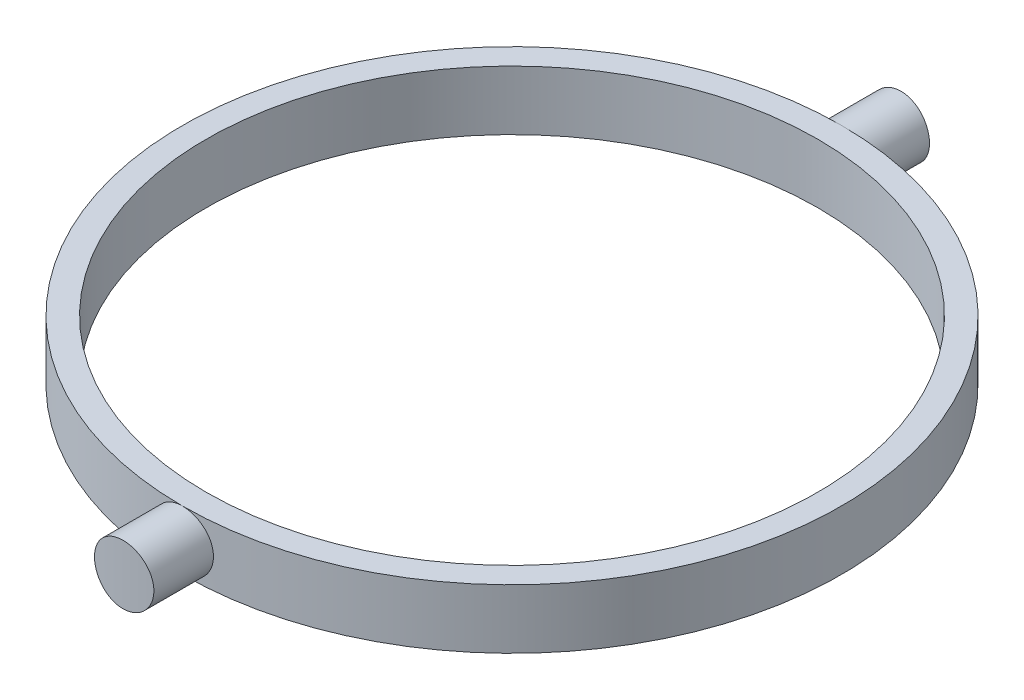
ISO-10303-21;
HEADER;
FILE_DESCRIPTION(('STEP AP214'),'2;1');
FILE_NAME('part.step','',(''),(''),'','','');
FILE_SCHEMA(('AUTOMOTIVE_DESIGN { 1 0 10303 214 1 1 1 1 }'));
ENDSEC;
DATA;
#1=APPLICATION_CONTEXT('core data for automotive mechanical design processes');
#2=APPLICATION_PROTOCOL_DEFINITION('international standard','automotive_design',2000,#1);
#3=PRODUCT_CONTEXT('',#1,'mechanical');
#4=PRODUCT('Part','Part','',(#3));
#5=PRODUCT_RELATED_PRODUCT_CATEGORY('part','',(#4));
#6=PRODUCT_DEFINITION_FORMATION('','',#4);
#7=PRODUCT_DEFINITION_CONTEXT('part definition',#1,'design');
#8=PRODUCT_DEFINITION('design','',#6,#7);
#9=PRODUCT_DEFINITION_SHAPE('','',#8);
#10=(LENGTH_UNIT() NAMED_UNIT(*) SI_UNIT(.MILLI.,.METRE.));
#11=(NAMED_UNIT(*) PLANE_ANGLE_UNIT() SI_UNIT($,.RADIAN.));
#12=(NAMED_UNIT(*) SI_UNIT($,.STERADIAN.) SOLID_ANGLE_UNIT());
#13=UNCERTAINTY_MEASURE_WITH_UNIT(LENGTH_MEASURE(1.E-05),#10,'distance_accuracy_value','');
#14=(GEOMETRIC_REPRESENTATION_CONTEXT(3) GLOBAL_UNCERTAINTY_ASSIGNED_CONTEXT((#13)) GLOBAL_UNIT_ASSIGNED_CONTEXT((#10,
#11,#12)) REPRESENTATION_CONTEXT('',''));
#15=CARTESIAN_POINT('',(0.,0.,0.));
#16=DIRECTION('',(0.,0.,1.));
#17=DIRECTION('',(1.,0.,0.));
#18=AXIS2_PLACEMENT_3D('',#15,#16,#17);
#19=CARTESIAN_POINT('',(0.,2.5,0.));
#20=DIRECTION('',(0.,-1.,0.));
#21=DIRECTION('',(0.,0.,-1.));
#22=AXIS2_PLACEMENT_3D('',#19,#20,#21);
#23=CYLINDRICAL_SURFACE('',#22,27.75);
#24=CARTESIAN_POINT('',(0.,2.5,-27.75));
#25=CARTESIAN_POINT('',(0.0701636798699895,2.50000690088817,-27.7500025790525));
#26=CARTESIAN_POINT('',(0.140323974462708,2.49704627125547,-27.7497339492877));
#27=CARTESIAN_POINT('',(0.280139841908848,2.48524338112585,-27.7486733268127));
#28=CARTESIAN_POINT('',(0.34979544614194,2.47640148953078,-27.7478813669284));
#29=CARTESIAN_POINT('',(0.488052874380236,2.45289969782349,-27.7457940407847));
#30=CARTESIAN_POINT('',(0.556655560620711,2.43824485461847,-27.7444991120973));
#31=CARTESIAN_POINT('',(0.692360655207406,2.40323823349337,-27.7414446799347));
#32=CARTESIAN_POINT('',(0.759463077056216,2.38288650686834,-27.7396851806426));
#33=CARTESIAN_POINT('',(0.957862366758913,2.31345849018642,-27.7337777508864));
#34=CARTESIAN_POINT('',(1.08631987342726,2.25599763178239,-27.7289997811642));
#35=CARTESIAN_POINT('',(1.33167825447004,2.12044899142266,-27.718302093102));
#36=CARTESIAN_POINT('',(1.44858069024329,2.04236400158889,-27.7123825293416));
#37=CARTESIAN_POINT('',(1.66795473274738,1.86752180473426,-27.7000457433074));
#38=CARTESIAN_POINT('',(1.77038907866499,1.77071785373396,-27.6936272997691));
#39=CARTESIAN_POINT('',(1.95758632151276,1.56127845742341,-27.6810257413625));
#40=CARTESIAN_POINT('',(2.04234651962052,1.44864059868319,-27.6748426625518));
#41=CARTESIAN_POINT('',(2.19191333655304,1.21050278199722,-27.6633994811436));
#42=CARTESIAN_POINT('',(2.25668603959202,1.08498143831527,-27.658140953804));
#43=CARTESIAN_POINT('',(2.36421718764613,0.824796916540191,-27.6491574198875));
#44=CARTESIAN_POINT('',(2.40697741389054,0.690134479134349,-27.6454322892345));
#45=CARTESIAN_POINT('',(2.46916370477388,0.415870917750558,-27.6399477650127));
#46=CARTESIAN_POINT('',(2.48865280196746,0.276284193829632,-27.6381830623055));
#47=CARTESIAN_POINT('',(2.50393834041468,-0.00419287642927001,-27.6368025434905));
#48=CARTESIAN_POINT('',(2.49973471390577,-0.145083226494542,-27.6371867335286));
#49=CARTESIAN_POINT('',(2.46780537259071,-0.423727511322421,-27.6400558309261));
#50=CARTESIAN_POINT('',(2.44014897358764,-0.56148946154816,-27.642534547734));
#51=CARTESIAN_POINT('',(2.36220699296649,-0.830407506804687,-27.6493037034528));
#52=CARTESIAN_POINT('',(2.31192126764704,-0.961563559880648,-27.6535941538686));
#53=CARTESIAN_POINT('',(2.19006978854026,-1.21377010982611,-27.6635105831221));
#54=CARTESIAN_POINT('',(2.11847263851155,-1.33480535725621,-27.6691385298919));
#55=CARTESIAN_POINT('',(1.95605650613453,-1.56316155929629,-27.6810937395354));
#56=CARTESIAN_POINT('',(1.86523794062599,-1.67048281123001,-27.6874209872426));
#57=CARTESIAN_POINT('',(1.66658351329327,-1.86875968670781,-27.7000887707036));
#58=CARTESIAN_POINT('',(1.55869014180603,-1.95965769566981,-27.7064292772115));
#59=CARTESIAN_POINT('',(1.32910299615601,-2.12208835113934,-27.7183905310299));
#60=CARTESIAN_POINT('',(1.20740500928562,-2.19361506349429,-27.7240110575064));
#61=CARTESIAN_POINT('',(0.953609006488008,-2.31526711009564,-27.7339010780216));
#62=CARTESIAN_POINT('',(0.821503502120575,-2.36537686469108,-27.7381695879607));
#63=CARTESIAN_POINT('',(0.550806311084661,-2.44261293653971,-27.744861746198));
#64=CARTESIAN_POINT('',(0.412224787338172,-2.46977406856255,-27.7472881884804));
#65=CARTESIAN_POINT('',(0.227235335134491,-2.49007071843544,-27.7491070775789));
#66=CARTESIAN_POINT('',(0.181828575699056,-2.49379607250729,-27.7494417257609));
#67=CARTESIAN_POINT('',(0.0909541541340856,-2.49875734325292,-27.749887906411));
#68=CARTESIAN_POINT('',(0.0454867203511223,-2.499997406946,-27.7499998105535));
#69=CARTESIAN_POINT('',(0.,-2.5,-27.75));
#70=B_SPLINE_CURVE_WITH_KNOTS('',3,(#24,#25,#26,#27,#28,#29,#30,#31,#32,#33,#34,#35,#36,#37,#38,
#39,#40,#41,#42,#43,#44,#45,#46,#47,#48,#49,#50,#51,#52,#53,#54,#55,#56,#57,#58,#59,#60,#61,#62,
#63,#64,#65,#66,#67,#68,#69),.UNSPECIFIED.,.F.,.F.,(4,2,2,2,2,2,2,2,2,2,2,2,2,2,2,2,2,2,2,2,2,2,
4),(0.,0.210422025051768,0.420830852637906,0.631057037639114,0.841281329812781,1.26152368703318,
1.68170918042835,2.10295781402603,2.52427072478553,2.94629465838554,3.36828443682866,
3.78912859520109,4.20997395721264,4.62957980819027,5.049188323798,5.46941809720676,
5.88963875835521,6.31130612894788,6.73310252628974,7.15520523706659,7.57666643088005,
7.71329918273047,7.84970375521056),.UNSPECIFIED.);
#71=CARTESIAN_POINT('',(0.,2.5,-27.75));
#72=VERTEX_POINT('',#71);
#73=CARTESIAN_POINT('',(0.,-2.5,-27.75));
#74=VERTEX_POINT('',#73);
#75=EDGE_CURVE('E65',#72,#74,#70,.T.);
#76=ORIENTED_EDGE('',*,*,#75,.F.);
#77=CARTESIAN_POINT('',(0.,2.5,0.));
#78=DIRECTION('',(0.,1.,0.));
#79=DIRECTION('',(0.,0.,1.));
#80=AXIS2_PLACEMENT_3D('',#77,#78,#79);
#81=CIRCLE('',#80,27.75);
#82=CARTESIAN_POINT('',(0.,2.5,27.75));
#83=VERTEX_POINT('',#82);
#84=EDGE_CURVE('E12',#83,#72,#81,.T.);
#85=ORIENTED_EDGE('',*,*,#84,.F.);
#86=CARTESIAN_POINT('',(0.,2.5,27.75));
#87=CARTESIAN_POINT('',(-0.140121344381133,2.49999389909915,27.7499985333475));
#88=CARTESIAN_POINT('',(-0.280337024479523,2.48817996532419,27.7489274033188));
#89=CARTESIAN_POINT('',(-0.556885892280247,2.44122748977689,27.744757443796));
#90=CARTESIAN_POINT('',(-0.693214548989113,2.40606280198291,27.7416563413813));
#91=CARTESIAN_POINT('',(-0.957944274771096,2.31343659460986,27.7337767307537));
#92=CARTESIAN_POINT('',(-1.08634989564267,2.25598801804106,27.7289991964055));
#93=CARTESIAN_POINT('',(-1.33166613179822,2.12044871637111,27.7183018964558));
#94=CARTESIAN_POINT('',(-1.44857913243647,2.0423622872292,27.71238236864));
#95=CARTESIAN_POINT('',(-1.66796620649888,1.86751562378348,27.7000453470236));
#96=CARTESIAN_POINT('',(-1.77040163764246,1.77070698829091,27.6936265888835));
#97=CARTESIAN_POINT('',(-1.95759401076692,1.56126666789594,27.6810250892004));
#98=CARTESIAN_POINT('',(-2.04235016070569,1.44863427445808,27.6748423582417));
#99=CARTESIAN_POINT('',(-2.19191145567616,1.21050630454951,27.6633996508263));
#100=CARTESIAN_POINT('',(-2.25668221081275,1.08498904545399,27.6581412715637));
#101=CARTESIAN_POINT('',(-2.36421447867756,0.824805128036202,27.6491576482776));
#102=CARTESIAN_POINT('',(-2.40697643936781,0.690138655998113,27.64543237305));
#103=CARTESIAN_POINT('',(-2.46916411655973,0.415869222424722,27.639947730822));
#104=CARTESIAN_POINT('',(-2.48865328684655,0.276280757007098,27.638183019221));
#105=CARTESIAN_POINT('',(-2.50393823148475,-0.00419633790220295,27.6368025526267));
#106=CARTESIAN_POINT('',(-2.49973451870468,-0.145084939184549,27.6371867511168));
#107=CARTESIAN_POINT('',(-2.46780541060505,-0.423727170412984,27.6400558274624));
#108=CARTESIAN_POINT('',(-2.44014909924374,-0.561488788991611,27.6425345354777));
#109=CARTESIAN_POINT('',(-2.36220724729611,-0.830406868327261,27.649303682741));
#110=CARTESIAN_POINT('',(-2.31192145307907,-0.961563255034676,27.653594142295));
#111=CARTESIAN_POINT('',(-2.19007113499225,-1.21376724388428,27.6635104700239));
#112=CARTESIAN_POINT('',(-2.11847574860003,-1.33479985590022,27.6691382726629));
#113=CARTESIAN_POINT('',(-1.95606079611214,-1.56315665617033,27.6810934518951));
#114=CARTESIAN_POINT('',(-1.8652407741072,-1.67048051922684,27.6874208450773));
#115=CARTESIAN_POINT('',(-1.66656774696785,-1.86877488506023,27.7000897374322));
#116=CARTESIAN_POINT('',(-1.55865504137435,-1.95968558605332,27.7064312062261));
#117=CARTESIAN_POINT('',(-1.32906779600803,-2.12211019698887,27.7183922650622));
#118=CARTESIAN_POINT('',(-1.20739324486637,-2.19362409090721,27.7240118545082));
#119=CARTESIAN_POINT('',(-0.953696347454379,-2.31522185613185,27.7338973358797));
#120=CARTESIAN_POINT('',(-0.821672653506548,-2.36530293092801,27.7381630511359));
#121=CARTESIAN_POINT('',(-0.551043628683298,-2.44257082039539,27.7448582257533));
#122=CARTESIAN_POINT('',(-0.412438457564772,-2.46975819048205,27.7472877296621));
#123=CARTESIAN_POINT('',(-0.13309914230342,-2.50039160267032,27.7500310253375));
#124=CARTESIAN_POINT('',(0.00762587758399086,-2.5039202158452,27.7503521753565));
#125=CARTESIAN_POINT('',(0.287665405129445,-2.48735247339558,27.7488622610517));
#126=CARTESIAN_POINT('',(0.426979928184103,-2.46725637593329,27.7470512200277));
#127=CARTESIAN_POINT('',(0.700007289149024,-2.40407812953165,27.7415052562889));
#128=CARTESIAN_POINT('',(0.833729088758776,-2.36103440278684,27.7377735497863));
#129=CARTESIAN_POINT('',(1.09205310190179,-2.25322208706815,27.7288052428431));
#130=CARTESIAN_POINT('',(1.21665514782016,-2.18845309892078,27.7235686147517));
#131=CARTESIAN_POINT('',(1.45357749264316,-2.03882235848235,27.7121586544399));
#132=CARTESIAN_POINT('',(1.56586322977475,-1.95390607736863,27.7059827967631));
#133=CARTESIAN_POINT('',(1.77461632460028,-1.76646975671491,27.6933962282694));
#134=CARTESIAN_POINT('',(1.87108336080406,-1.66394935948568,27.6869855126828));
#135=CARTESIAN_POINT('',(2.04574527378121,-1.44385591266351,27.6746298326558));
#136=CARTESIAN_POINT('',(2.12388614857188,-1.32623991794537,27.6686862781879));
#137=CARTESIAN_POINT('',(2.25930696677598,-1.07950697513845,27.6579584613565));
#138=CARTESIAN_POINT('',(2.31658714837295,-0.950390158384889,27.6531741857567));
#139=CARTESIAN_POINT('',(2.40856922343252,-0.684509625997638,27.6453149185799));
#140=CARTESIAN_POINT('',(2.44330381832744,-0.547757299667154,27.6422374522952));
#141=CARTESIAN_POINT('',(2.4893150652258,-0.270332517932561,27.6381322189087));
#142=CARTESIAN_POINT('',(2.50059225255014,-0.12966015206182,27.6371044050319));
#143=CARTESIAN_POINT('',(2.49936191308142,0.151074854612057,27.6372156572686));
#144=CARTESIAN_POINT('',(2.4869392262074,0.291137878074739,27.6383469941407));
#145=CARTESIAN_POINT('',(2.43883905634239,0.567179260960797,27.6426326312279));
#146=CARTESIAN_POINT('',(2.40316154114958,0.703157614727709,27.6457869342441));
#147=CARTESIAN_POINT('',(2.3095867205331,0.967172838214389,27.6537610189234));
#148=CARTESIAN_POINT('',(2.25169132481454,1.0952103893757,27.6585806574415));
#149=CARTESIAN_POINT('',(2.11533333131458,1.3397630504698,27.6693426334634));
#150=CARTESIAN_POINT('',(2.03687097630472,1.45627829638906,27.6752849577149));
#151=CARTESIAN_POINT('',(1.86128734030178,1.67491348526722,27.6876481445009));
#152=CARTESIAN_POINT('',(1.76410303324333,1.77698272426722,27.6940705772799));
#153=CARTESIAN_POINT('',(1.55395351361977,1.96340505664467,27.7066559589375));
#154=CARTESIAN_POINT('',(1.4409845034568,2.04775387445286,27.7128188449067));
#155=CARTESIAN_POINT('',(1.20221930714792,2.19647441064541,27.7242037450216));
#156=CARTESIAN_POINT('',(1.07639656081237,2.26080360544646,27.7294237466624));
#157=CARTESIAN_POINT('',(0.81577218521584,2.3673383015084,27.7383118984964));
#158=CARTESIAN_POINT('',(0.680981000645693,2.40956904748372,27.7419818185354));
#159=CARTESIAN_POINT('',(0.454505605811526,2.46003879881015,27.7464218278406));
#160=CARTESIAN_POINT('',(0.36427466445775,2.47500411888036,27.7477574771317));
#161=CARTESIAN_POINT('',(0.182709185094387,2.49498669281434,27.7495470400127));
#162=CARTESIAN_POINT('',(0.0913746506118993,2.50000397846371,27.75000095642));
#163=CARTESIAN_POINT('',(0.,2.5,27.75));
#164=B_SPLINE_CURVE_WITH_KNOTS('',3,(#86,#87,#88,#89,#90,#91,#92,#93,#94,#95,#96,#97,#98,#99,
#100,#101,#102,#103,#104,#105,#106,#107,#108,#109,#110,#111,#112,#113,#114,#115,#116,#117,#118,
#119,#120,#121,#122,#123,#124,#125,#126,#127,#128,#129,#130,#131,#132,#133,#134,#135,#136,#137,
#138,#139,#140,#141,#142,#143,#144,#145,#146,#147,#148,#149,#150,#151,#152,#153,#154,#155,#156,
#157,#158,#159,#160,#161,#162,#163),.UNSPECIFIED.,.T.,.F.,(4,2,2,2,2,2,2,2,2,2,2,2,2,2,2,2,2,2,
2,2,2,2,2,2,2,2,2,2,2,2,2,2,2,2,2,2,2,2,4),(0.,0.420030397322875,0.840531900794828,
1.26078953187274,1.68095975125681,2.10223108889209,2.52352129567732,2.94553244656898,
3.36753500760135,3.78838432274332,4.20922452799575,4.62882935977342,5.04843889458966,
5.46865912860918,5.8888893292032,6.31062103920034,6.7323530975981,7.15414016596295,
7.57591700121787,7.99622102972192,8.41652046533975,8.83611837569851,9.25572399604687,
9.6764785047575,10.0972415635805,10.5192293357115,10.9412122895129,11.3625817987516,
11.7839416918219,12.2037960463737,12.6236509823143,13.0434698383241,13.4632837390329,
13.8845364210656,14.3058906261779,14.7281338135262,15.1498935819477,15.423800841421,
15.6977072257143),.UNSPECIFIED.);
#165=CARTESIAN_POINT('',(0.,-2.5,27.75));
#166=VERTEX_POINT('',#165);
#167=EDGE_CURVE('E58',#166,#83,#164,.T.);
#168=ORIENTED_EDGE('',*,*,#167,.F.);
#169=CARTESIAN_POINT('',(0.,-2.5,0.));
#170=DIRECTION('',(0.,1.,0.));
#171=DIRECTION('',(0.,0.,1.));
#172=AXIS2_PLACEMENT_3D('',#169,#170,#171);
#173=CIRCLE('',#172,27.75);
#174=EDGE_CURVE('E38',#166,#74,#173,.T.);
#175=ORIENTED_EDGE('',*,*,#174,.T.);
#176=EDGE_LOOP('',(#76,#85,#168,#175));
#177=FACE_BOUND('',#176,.T.);
#178=ADVANCED_FACE('F34',(#177),#23,.T.);
#179=CARTESIAN_POINT('',(0.,-2.5,-27.75));
#180=CARTESIAN_POINT('',(-0.0701636798699894,-2.50000690088817,-27.7500025790525));
#181=CARTESIAN_POINT('',(-0.140323974462708,-2.49704627125547,-27.7497339492877));
#182=CARTESIAN_POINT('',(-0.280139841908848,-2.48524338112585,-27.7486733268127));
#183=CARTESIAN_POINT('',(-0.34979544614194,-2.47640148953078,-27.7478813669284));
#184=CARTESIAN_POINT('',(-0.488052874380236,-2.45289969782349,-27.7457940407847));
#185=CARTESIAN_POINT('',(-0.556655560620711,-2.43824485461847,-27.7444991120973));
#186=CARTESIAN_POINT('',(-0.692360655207406,-2.40323823349337,-27.7414446799347));
#187=CARTESIAN_POINT('',(-0.759463077056216,-2.38288650686834,-27.7396851806426));
#188=CARTESIAN_POINT('',(-0.957862366758913,-2.31345849018642,-27.7337777508864));
#189=CARTESIAN_POINT('',(-1.08631987342726,-2.25599763178239,-27.7289997811642));
#190=CARTESIAN_POINT('',(-1.33167825447004,-2.12044899142266,-27.718302093102));
#191=CARTESIAN_POINT('',(-1.44858069024329,-2.04236400158889,-27.7123825293416));
#192=CARTESIAN_POINT('',(-1.66795473274738,-1.86752180473426,-27.7000457433074));
#193=CARTESIAN_POINT('',(-1.77038907866499,-1.77071785373396,-27.6936272997691));
#194=CARTESIAN_POINT('',(-1.95758632151276,-1.56127845742341,-27.6810257413625));
#195=CARTESIAN_POINT('',(-2.04234651962052,-1.44864059868319,-27.6748426625518));
#196=CARTESIAN_POINT('',(-2.19191333655304,-1.21050278199722,-27.6633994811436));
#197=CARTESIAN_POINT('',(-2.25668603959202,-1.08498143831527,-27.658140953804));
#198=CARTESIAN_POINT('',(-2.36421718764613,-0.824796916540191,-27.6491574198875));
#199=CARTESIAN_POINT('',(-2.40697741389054,-0.690134479134349,-27.6454322892345));
#200=CARTESIAN_POINT('',(-2.46916370477388,-0.415870917750558,-27.6399477650127));
#201=CARTESIAN_POINT('',(-2.48865280196746,-0.276284193829632,-27.6381830623055));
#202=CARTESIAN_POINT('',(-2.50393834041468,0.00419287642927058,-27.6368025434905));
#203=CARTESIAN_POINT('',(-2.49973471390577,0.145083226494542,-27.6371867335286));
#204=CARTESIAN_POINT('',(-2.46780537259071,0.423727511322422,-27.6400558309261));
#205=CARTESIAN_POINT('',(-2.44014897358764,0.56148946154816,-27.642534547734));
#206=CARTESIAN_POINT('',(-2.36220699296649,0.830407506804687,-27.6493037034528));
#207=CARTESIAN_POINT('',(-2.31192126764704,0.961563559880648,-27.6535941538686));
#208=CARTESIAN_POINT('',(-2.19006978854026,1.21377010982612,-27.6635105831221));
#209=CARTESIAN_POINT('',(-2.11847263851155,1.33480535725621,-27.6691385298919));
#210=CARTESIAN_POINT('',(-1.95605650613453,1.56316155929629,-27.6810937395354));
#211=CARTESIAN_POINT('',(-1.86523794062599,1.67048281123001,-27.6874209872426));
#212=CARTESIAN_POINT('',(-1.66658351329327,1.86875968670781,-27.7000887707036));
#213=CARTESIAN_POINT('',(-1.55869014180603,1.95965769566981,-27.7064292772115));
#214=CARTESIAN_POINT('',(-1.32910299615601,2.12208835113934,-27.7183905310299));
#215=CARTESIAN_POINT('',(-1.20740500928562,2.19361506349429,-27.7240110575064));
#216=CARTESIAN_POINT('',(-0.953609006488008,2.31526711009564,-27.7339010780216));
#217=CARTESIAN_POINT('',(-0.821503502120575,2.36537686469108,-27.7381695879607));
#218=CARTESIAN_POINT('',(-0.550806311084661,2.44261293653971,-27.744861746198));
#219=CARTESIAN_POINT('',(-0.412224787338172,2.46977406856255,-27.7472881884804));
#220=CARTESIAN_POINT('',(-0.227235335134491,2.49007071843544,-27.7491070775789));
#221=CARTESIAN_POINT('',(-0.181828575699055,2.49379607250729,-27.7494417257609));
#222=CARTESIAN_POINT('',(-0.0909541541340854,2.49875734325292,-27.749887906411));
#223=CARTESIAN_POINT('',(-0.0454867203511223,2.499997406946,-27.7499998105535));
#224=CARTESIAN_POINT('',(0.,2.5,-27.75));
#225=B_SPLINE_CURVE_WITH_KNOTS('',3,(#179,#180,#181,#182,#183,#184,#185,#186,#187,#188,#189,
#190,#191,#192,#193,#194,#195,#196,#197,#198,#199,#200,#201,#202,#203,#204,#205,#206,#207,#208,
#209,#210,#211,#212,#213,#214,#215,#216,#217,#218,#219,#220,#221,#222,#223,#224),.UNSPECIFIED.,
.F.,.F.,(4,2,2,2,2,2,2,2,2,2,2,2,2,2,2,2,2,2,2,2,2,2,4),(0.,0.210422025051768,0.420830852637906,
0.631057037639114,0.841281329812781,1.26152368703318,1.68170918042835,2.10295781402603,
2.52427072478553,2.94629465838554,3.36828443682866,3.78912859520109,4.20997395721264,
4.62957980819027,5.049188323798,5.46941809720676,5.88963875835521,6.31130612894788,
6.73310252628974,7.15520523706659,7.57666643088005,7.71329918273047,7.84970375521056),.UNSPECIFIED.);
#226=EDGE_CURVE('E50',#74,#72,#225,.T.);
#227=ORIENTED_EDGE('',*,*,#226,.F.);
#228=EDGE_CURVE('E72',#74,#166,#173,.T.);
#229=ORIENTED_EDGE('',*,*,#228,.T.);
#230=EDGE_CURVE('E70',#83,#166,#164,.T.);
#231=ORIENTED_EDGE('',*,*,#230,.F.);
#232=EDGE_CURVE('E43',#72,#83,#81,.T.);
#233=ORIENTED_EDGE('',*,*,#232,.F.);
#234=EDGE_LOOP('',(#227,#229,#231,#233));
#235=FACE_BOUND('',#234,.T.);
#236=ADVANCED_FACE('F71',(#235),#23,.T.);
#237=CARTESIAN_POINT('',(0.,2.5,0.));
#238=DIRECTION('',(0.,-1.,0.));
#239=DIRECTION('',(0.,0.,-1.));
#240=AXIS2_PLACEMENT_3D('',#237,#238,#239);
#241=CYLINDRICAL_SURFACE('',#240,25.75);
#242=CARTESIAN_POINT('',(0.,2.5,0.));
#243=DIRECTION('',(0.,1.,0.));
#244=DIRECTION('',(0.,0.,1.));
#245=AXIS2_PLACEMENT_3D('',#242,#243,#244);
#246=CIRCLE('',#245,25.75);
#247=CARTESIAN_POINT('',(0.,2.5,25.75));
#248=VERTEX_POINT('',#247);
#249=EDGE_CURVE('E116',#248,#248,#246,.T.);
#250=ORIENTED_EDGE('',*,*,#249,.T.);
#251=EDGE_LOOP('',(#250));
#252=FACE_BOUND('',#251,.T.);
#253=CARTESIAN_POINT('',(0.,-2.5,0.));
#254=DIRECTION('',(0.,1.,0.));
#255=DIRECTION('',(0.,0.,1.));
#256=AXIS2_PLACEMENT_3D('',#253,#254,#255);
#257=CIRCLE('',#256,25.75);
#258=CARTESIAN_POINT('',(0.,-2.5,25.75));
#259=VERTEX_POINT('',#258);
#260=EDGE_CURVE('E115',#259,#259,#257,.T.);
#261=ORIENTED_EDGE('',*,*,#260,.F.);
#262=EDGE_LOOP('',(#261));
#263=FACE_BOUND('',#262,.T.);
#264=ADVANCED_FACE('F105',(#252,#263),#241,.F.);
#265=CARTESIAN_POINT('',(0.,2.5,0.));
#266=DIRECTION('',(0.,1.,0.));
#267=DIRECTION('',(0.,0.,1.));
#268=AXIS2_PLACEMENT_3D('',#265,#266,#267);
#269=PLANE('',#268);
#270=ORIENTED_EDGE('',*,*,#249,.F.);
#271=EDGE_LOOP('',(#270));
#272=FACE_BOUND('',#271,.T.);
#273=ORIENTED_EDGE('',*,*,#84,.T.);
#274=ORIENTED_EDGE('',*,*,#232,.T.);
#275=EDGE_LOOP('',(#273,#274));
#276=FACE_BOUND('',#275,.T.);
#277=ADVANCED_FACE('F68',(#272,#276),#269,.T.);
#278=CARTESIAN_POINT('',(0.,-2.5,0.));
#279=DIRECTION('',(0.,1.,0.));
#280=DIRECTION('',(0.,0.,1.));
#281=AXIS2_PLACEMENT_3D('',#278,#279,#280);
#282=PLANE('',#281);
#283=ORIENTED_EDGE('',*,*,#260,.T.);
#284=EDGE_LOOP('',(#283));
#285=FACE_BOUND('',#284,.T.);
#286=ORIENTED_EDGE('',*,*,#228,.F.);
#287=ORIENTED_EDGE('',*,*,#174,.F.);
#288=EDGE_LOOP('',(#286,#287));
#289=FACE_BOUND('',#288,.T.);
#290=ADVANCED_FACE('F122',(#285,#289),#282,.F.);
#291=CARTESIAN_POINT('',(0.,2.5,0.));
#292=DIRECTION('',(0.,-1.,0.));
#293=DIRECTION('',(0.,0.,-1.));
#294=AXIS2_PLACEMENT_3D('',#291,#292,#293);
#295=CYLINDRICAL_SURFACE('',#294,32.75);
#296=CARTESIAN_POINT('',(-2.5,0.,32.6544407393543));
#297=CARTESIAN_POINT('',(-2.49999385808399,0.140206430183721,32.6544420100591));
#298=CARTESIAN_POINT('',(-2.48816563027397,0.280509312622175,32.655353450804));
#299=CARTESIAN_POINT('',(-2.44115307440355,0.557235983409779,32.6589008682075));
#300=CARTESIAN_POINT('',(-2.40594201673813,0.69365514582757,32.6615388184404));
#301=CARTESIAN_POINT('',(-2.31318550858892,0.958566211835327,32.6682387367694));
#302=CARTESIAN_POINT('',(-2.25565239907701,1.08706245028103,32.6722999178981));
#303=CARTESIAN_POINT('',(-2.11990618975326,1.33254227674836,32.6813877136966));
#304=CARTESIAN_POINT('',(-2.04169762637937,1.44952838251176,32.6864141165192));
#305=CARTESIAN_POINT('',(-1.86663598894077,1.66895336665748,32.6968783081677));
#306=CARTESIAN_POINT('',(-1.76974728477311,1.77136378422024,32.7023168709104));
#307=CARTESIAN_POINT('',(-1.56015057833512,1.95848610838142,32.7129854691166));
#308=CARTESIAN_POINT('',(-1.44744189691802,2.04319725476682,32.7182154956152));
#309=CARTESIAN_POINT('',(-1.20923750810989,2.19260899271465,32.7278848810087));
#310=CARTESIAN_POINT('',(-1.08372650939848,2.25728527326839,32.7323232765632));
#311=CARTESIAN_POINT('',(-0.823587144079658,2.36463582377303,32.7399010222317));
#312=CARTESIAN_POINT('',(-0.688958914257094,2.40731042373008,32.7430403918297));
#313=CARTESIAN_POINT('',(-0.414687399046134,2.46936517464525,32.7476609704774));
#314=CARTESIAN_POINT('',(-0.275054493278831,2.48879095613935,32.7491454272364));
#315=CARTESIAN_POINT('',(0.00549736065390169,2.50393765177322,32.7502999059301));
#316=CARTESIAN_POINT('',(0.146416288327268,2.49965894297506,32.7499699567261));
#317=CARTESIAN_POINT('',(0.42523073883012,2.4675555440041,32.7475354899222));
#318=CARTESIAN_POINT('',(0.563131948789738,2.43977992650412,32.7454346707699));
#319=CARTESIAN_POINT('',(0.832309142052361,2.3615474068483,32.739699093807));
#320=CARTESIAN_POINT('',(0.963585070972961,2.31109031854943,32.7360643234077));
#321=CARTESIAN_POINT('',(1.21594193159209,2.18887213316396,32.7276635119421));
#322=CARTESIAN_POINT('',(1.33701213234178,2.11708896250337,32.7228962997711));
#323=CARTESIAN_POINT('',(1.56540365608984,1.95427230752502,32.7127666265028));
#324=CARTESIAN_POINT('',(1.67272474576007,1.86323849658538,32.7074041553066));
#325=CARTESIAN_POINT('',(1.87085833268858,1.66422788764794,32.6966707876888));
#326=CARTESIAN_POINT('',(1.96162802415308,1.55620846632606,32.6912999046647));
#327=CARTESIAN_POINT('',(2.12375173684352,1.32644173937697,32.6811688587788));
#328=CARTESIAN_POINT('',(2.19510574554636,1.20469442489537,32.6764086963109));
#329=CARTESIAN_POINT('',(2.31637046476236,0.950898858614326,32.668036992726));
#330=CARTESIAN_POINT('',(2.36627910781627,0.818849615097721,32.6644255623622));
#331=CARTESIAN_POINT('',(2.44320546995151,0.548212232896722,32.6587621899689));
#332=CARTESIAN_POINT('',(2.47022359199114,0.409624209364516,32.6567102204872));
#333=CARTESIAN_POINT('',(2.50054809421499,0.130217404724196,32.65440237776));
#334=CARTESIAN_POINT('',(2.50391409746872,-0.0105948696838553,32.6541419882729));
#335=CARTESIAN_POINT('',(2.48699484842308,-0.290781794676544,32.6554348586769));
#336=CARTESIAN_POINT('',(2.46670978075663,-0.430156456475385,32.6569881044099));
#337=CARTESIAN_POINT('',(2.40311384868859,-0.703341600489551,32.6617291047223));
#338=CARTESIAN_POINT('',(2.35983067467935,-0.837158565871089,32.6649148935084));
#339=CARTESIAN_POINT('',(2.25149529065049,-1.09563031072493,32.6725603627812));
#340=CARTESIAN_POINT('',(2.18644278679214,-1.22028496649823,32.6770200604627));
#341=CARTESIAN_POINT('',(2.03626392394141,-1.45716682828869,32.6867217844784));
#342=CARTESIAN_POINT('',(1.95109775267775,-1.56936872986335,32.6919653547285));
#343=CARTESIAN_POINT('',(1.76316677089703,-1.77790464542722,32.7026386968531));
#344=CARTESIAN_POINT('',(1.66040170573964,-1.87423842977935,32.7080684714209));
#345=CARTESIAN_POINT('',(1.43993278739121,-2.04850628707495,32.718515773718));
#346=CARTESIAN_POINT('',(1.32219831141822,-2.12640167869948,32.7235324206412));
#347=CARTESIAN_POINT('',(1.07528570976534,-2.26131644900403,32.732575547792));
#348=CARTESIAN_POINT('',(0.946107682534769,-2.31833600725802,32.7366020365369));
#349=CARTESIAN_POINT('',(0.680114794220758,-2.40981378726257,32.7432070690796));
#350=CARTESIAN_POINT('',(0.543308270115467,-2.44429613446543,32.7457871607824));
#351=CARTESIAN_POINT('',(0.265826911824732,-2.48979955343614,32.7492149405878));
#352=CARTESIAN_POINT('',(0.12515213794916,-2.50082099077314,32.7500626556843));
#353=CARTESIAN_POINT('',(-0.155690645927458,-2.49908576085302,32.7499302261492));
#354=CARTESIAN_POINT('',(-0.295859035111573,-2.48638946671942,32.7489547224901));
#355=CARTESIAN_POINT('',(-0.572066961662316,-2.4377048118383,32.7452946774762));
#356=CARTESIAN_POINT('',(-0.708106492730538,-2.4017164155615,32.7426101335144));
#357=CARTESIAN_POINT('',(-0.972200714257219,-2.30748390828662,32.7358334008966));
#358=CARTESIAN_POINT('',(-1.10025569376758,-2.24924060349202,32.7317412632323));
#359=CARTESIAN_POINT('',(-1.3447789888458,-2.11215887383356,32.7226077550709));
#360=CARTESIAN_POINT('',(-1.46124753043504,-2.0333208508281,32.7175664030959));
#361=CARTESIAN_POINT('',(-1.67960021989857,-1.8570615889501,32.7070854919445));
#362=CARTESIAN_POINT('',(-1.78144845116006,-1.75959591214745,32.7016450001042));
#363=CARTESIAN_POINT('',(-1.96737812263165,-1.54892329126696,32.6909868427403));
#364=CARTESIAN_POINT('',(-2.05145523807485,-1.43571252656326,32.6857692317027));
#365=CARTESIAN_POINT('',(-2.1995505550947,-1.1965773180019,32.6761382513364));
#366=CARTESIAN_POINT('',(-2.26353568946727,-1.07063236191905,32.6717262127536));
#367=CARTESIAN_POINT('',(-2.3693704935409,-0.809841082559614,32.6642223944283));
#368=CARTESIAN_POINT('',(-2.41124578786615,-0.675005268383354,32.6611290871214));
#369=CARTESIAN_POINT('',(-2.46092639343982,-0.449469070625407,32.6574140997774));
#370=CARTESIAN_POINT('',(-2.47555971445422,-0.360222056537095,32.6563041623395));
#371=CARTESIAN_POINT('',(-2.49509848607673,-0.180663378185085,32.6548170734963));
#372=CARTESIAN_POINT('',(-2.50000395796863,-0.090351716251191,32.6544399204877));
#373=CARTESIAN_POINT('',(-2.5,0.,32.6544407393543));
#374=B_SPLINE_CURVE_WITH_KNOTS('',3,(#296,#297,#298,#299,#300,#301,#302,#303,#304,#305,#306,
#307,#308,#309,#310,#311,#312,#313,#314,#315,#316,#317,#318,#319,#320,#321,#322,#323,#324,#325,
#326,#327,#328,#329,#330,#331,#332,#333,#334,#335,#336,#337,#338,#339,#340,#341,#342,#343,#344,
#345,#346,#347,#348,#349,#350,#351,#352,#353,#354,#355,#356,#357,#358,#359,#360,#361,#362,#363,
#364,#365,#366,#367,#368,#369,#370,#371,#372,#373),.UNSPECIFIED.,.T.,.F.,(4,2,2,2,2,2,2,2,2,2,2,
2,2,2,2,2,2,2,2,2,2,2,2,2,2,2,2,2,2,2,2,2,2,2,2,2,2,2,4),(0.,0.420289418740226,
0.841060111694184,1.26159850804208,1.68204470978709,2.10330094048471,2.5245752611175,
2.94635878627161,3.36813598485407,3.78908399512025,4.21002530947896,4.63008966322733,
5.05015746443635,5.47066158091772,5.89117283258337,6.31275665982654,6.73434075899008,
7.15596549222398,7.57758280314037,7.99813690420215,8.41868772221569,8.83873332835953,
9.25878460443662,9.67967438822399,10.1005702624263,10.5223414464848,10.9441090023814,
11.3654243252386,11.7867330830898,12.206970866982,12.6272092918977,13.0474324947529,
13.4676474985343,13.8888777662945,14.3102104266453,14.7322329215874,15.1537652258238,
15.4246083914324,15.6954509644559),.UNSPECIFIED.);
#375=CARTESIAN_POINT('',(-2.5,0.,32.6544407393543));
#376=VERTEX_POINT('',#375);
#377=EDGE_CURVE('E77',#376,#376,#374,.T.);
#378=ORIENTED_EDGE('',*,*,#377,.F.);
#379=EDGE_LOOP('',(#378));
#380=FACE_BOUND('',#379,.T.);
#381=ADVANCED_FACE('F102',(#380),#295,.T.);
#382=CARTESIAN_POINT('',(0.,0.,37.751));
#383=DIRECTION('',(0.,0.,-1.));
#384=DIRECTION('',(-1.,0.,0.));
#385=AXIS2_PLACEMENT_3D('',#382,#383,#384);
#386=CYLINDRICAL_SURFACE('',#385,2.5);
#387=ORIENTED_EDGE('',*,*,#377,.T.);
#388=EDGE_LOOP('',(#387));
#389=FACE_BOUND('',#388,.T.);
#390=ORIENTED_EDGE('',*,*,#167,.T.);
#391=ORIENTED_EDGE('',*,*,#230,.T.);
#392=EDGE_LOOP('',(#390,#391));
#393=FACE_BOUND('',#392,.T.);
#394=ADVANCED_FACE('F76',(#389,#393),#386,.T.);
#395=CARTESIAN_POINT('',(2.5,0.,-32.6544407393543));
#396=CARTESIAN_POINT('',(2.49999385808399,-0.140206430183721,-32.6544420100591));
#397=CARTESIAN_POINT('',(2.48816563027397,-0.280509312622175,-32.655353450804));
#398=CARTESIAN_POINT('',(2.44115307440355,-0.557235983409779,-32.6589008682075));
#399=CARTESIAN_POINT('',(2.40594201673813,-0.69365514582757,-32.6615388184404));
#400=CARTESIAN_POINT('',(2.31318550858892,-0.958566211835327,-32.6682387367694));
#401=CARTESIAN_POINT('',(2.25565239907701,-1.08706245028103,-32.6722999178981));
#402=CARTESIAN_POINT('',(2.11990618975326,-1.33254227674836,-32.6813877136966));
#403=CARTESIAN_POINT('',(2.04169762637937,-1.44952838251176,-32.6864141165192));
#404=CARTESIAN_POINT('',(1.86663598894077,-1.66895336665748,-32.6968783081677));
#405=CARTESIAN_POINT('',(1.76974728477311,-1.77136378422024,-32.7023168709104));
#406=CARTESIAN_POINT('',(1.56015057833512,-1.95848610838142,-32.7129854691166));
#407=CARTESIAN_POINT('',(1.44744189691802,-2.04319725476682,-32.7182154956152));
#408=CARTESIAN_POINT('',(1.20923750810989,-2.19260899271465,-32.7278848810087));
#409=CARTESIAN_POINT('',(1.08372650939848,-2.25728527326839,-32.7323232765632));
#410=CARTESIAN_POINT('',(0.823587144079658,-2.36463582377303,-32.7399010222317));
#411=CARTESIAN_POINT('',(0.688958914257094,-2.40731042373008,-32.7430403918297));
#412=CARTESIAN_POINT('',(0.414687399046134,-2.46936517464525,-32.7476609704774));
#413=CARTESIAN_POINT('',(0.275054493278831,-2.48879095613935,-32.7491454272364));
#414=CARTESIAN_POINT('',(-0.00549736065390169,-2.50393765177322,-32.7502999059301));
#415=CARTESIAN_POINT('',(-0.146416288327268,-2.49965894297506,-32.7499699567261));
#416=CARTESIAN_POINT('',(-0.42523073883012,-2.4675555440041,-32.7475354899222));
#417=CARTESIAN_POINT('',(-0.563131948789738,-2.43977992650412,-32.7454346707699));
#418=CARTESIAN_POINT('',(-0.832309142052361,-2.3615474068483,-32.739699093807));
#419=CARTESIAN_POINT('',(-0.963585070972961,-2.31109031854943,-32.7360643234077));
#420=CARTESIAN_POINT('',(-1.21594193159209,-2.18887213316396,-32.7276635119421));
#421=CARTESIAN_POINT('',(-1.33701213234178,-2.11708896250337,-32.7228962997711));
#422=CARTESIAN_POINT('',(-1.56540365608984,-1.95427230752502,-32.7127666265028));
#423=CARTESIAN_POINT('',(-1.67272474576007,-1.86323849658538,-32.7074041553066));
#424=CARTESIAN_POINT('',(-1.87085833268858,-1.66422788764794,-32.6966707876888));
#425=CARTESIAN_POINT('',(-1.96162802415308,-1.55620846632606,-32.6912999046647));
#426=CARTESIAN_POINT('',(-2.12375173684352,-1.32644173937697,-32.6811688587788));
#427=CARTESIAN_POINT('',(-2.19510574554636,-1.20469442489537,-32.6764086963109));
#428=CARTESIAN_POINT('',(-2.31637046476236,-0.950898858614326,-32.668036992726));
#429=CARTESIAN_POINT('',(-2.36627910781627,-0.818849615097721,-32.6644255623622));
#430=CARTESIAN_POINT('',(-2.44320546995151,-0.548212232896722,-32.6587621899689));
#431=CARTESIAN_POINT('',(-2.47022359199114,-0.409624209364516,-32.6567102204872));
#432=CARTESIAN_POINT('',(-2.50054809421499,-0.130217404724196,-32.65440237776));
#433=CARTESIAN_POINT('',(-2.50391409746872,0.0105948696838553,-32.6541419882729));
#434=CARTESIAN_POINT('',(-2.48699484842308,0.290781794676544,-32.6554348586769));
#435=CARTESIAN_POINT('',(-2.46670978075663,0.430156456475385,-32.6569881044099));
#436=CARTESIAN_POINT('',(-2.40311384868859,0.703341600489551,-32.6617291047223));
#437=CARTESIAN_POINT('',(-2.35983067467935,0.837158565871089,-32.6649148935084));
#438=CARTESIAN_POINT('',(-2.25149529065049,1.09563031072493,-32.6725603627812));
#439=CARTESIAN_POINT('',(-2.18644278679214,1.22028496649823,-32.6770200604627));
#440=CARTESIAN_POINT('',(-2.03626392394141,1.45716682828869,-32.6867217844784));
#441=CARTESIAN_POINT('',(-1.95109775267775,1.56936872986335,-32.6919653547285));
#442=CARTESIAN_POINT('',(-1.76316677089703,1.77790464542722,-32.7026386968531));
#443=CARTESIAN_POINT('',(-1.66040170573964,1.87423842977935,-32.7080684714209));
#444=CARTESIAN_POINT('',(-1.43993278739121,2.04850628707495,-32.718515773718));
#445=CARTESIAN_POINT('',(-1.32219831141822,2.12640167869948,-32.7235324206412));
#446=CARTESIAN_POINT('',(-1.07528570976534,2.26131644900403,-32.732575547792));
#447=CARTESIAN_POINT('',(-0.946107682534769,2.31833600725802,-32.7366020365369));
#448=CARTESIAN_POINT('',(-0.680114794220758,2.40981378726257,-32.7432070690796));
#449=CARTESIAN_POINT('',(-0.543308270115467,2.44429613446543,-32.7457871607824));
#450=CARTESIAN_POINT('',(-0.265826911824732,2.48979955343614,-32.7492149405878));
#451=CARTESIAN_POINT('',(-0.12515213794916,2.50082099077314,-32.7500626556843));
#452=CARTESIAN_POINT('',(0.155690645927458,2.49908576085302,-32.7499302261492));
#453=CARTESIAN_POINT('',(0.295859035111573,2.48638946671942,-32.7489547224901));
#454=CARTESIAN_POINT('',(0.572066961662316,2.4377048118383,-32.7452946774762));
#455=CARTESIAN_POINT('',(0.708106492730538,2.4017164155615,-32.7426101335144));
#456=CARTESIAN_POINT('',(0.972200714257219,2.30748390828662,-32.7358334008966));
#457=CARTESIAN_POINT('',(1.10025569376758,2.24924060349202,-32.7317412632323));
#458=CARTESIAN_POINT('',(1.3447789888458,2.11215887383356,-32.7226077550709));
#459=CARTESIAN_POINT('',(1.46124753043504,2.0333208508281,-32.7175664030959));
#460=CARTESIAN_POINT('',(1.67960021989857,1.8570615889501,-32.7070854919445));
#461=CARTESIAN_POINT('',(1.78144845116006,1.75959591214745,-32.7016450001042));
#462=CARTESIAN_POINT('',(1.96737812263165,1.54892329126696,-32.6909868427403));
#463=CARTESIAN_POINT('',(2.05145523807485,1.43571252656326,-32.6857692317027));
#464=CARTESIAN_POINT('',(2.1995505550947,1.1965773180019,-32.6761382513364));
#465=CARTESIAN_POINT('',(2.26353568946727,1.07063236191905,-32.6717262127536));
#466=CARTESIAN_POINT('',(2.3693704935409,0.809841082559614,-32.6642223944283));
#467=CARTESIAN_POINT('',(2.41124578786615,0.675005268383354,-32.6611290871214));
#468=CARTESIAN_POINT('',(2.46092639343982,0.449469070625407,-32.6574140997774));
#469=CARTESIAN_POINT('',(2.47555971445422,0.360222056537095,-32.6563041623395));
#470=CARTESIAN_POINT('',(2.49509848607673,0.180663378185085,-32.6548170734963));
#471=CARTESIAN_POINT('',(2.50000395796863,0.090351716251191,-32.6544399204877));
#472=CARTESIAN_POINT('',(2.5,0.,-32.6544407393543));
#473=B_SPLINE_CURVE_WITH_KNOTS('',3,(#395,#396,#397,#398,#399,#400,#401,#402,#403,#404,#405,
#406,#407,#408,#409,#410,#411,#412,#413,#414,#415,#416,#417,#418,#419,#420,#421,#422,#423,#424,
#425,#426,#427,#428,#429,#430,#431,#432,#433,#434,#435,#436,#437,#438,#439,#440,#441,#442,#443,
#444,#445,#446,#447,#448,#449,#450,#451,#452,#453,#454,#455,#456,#457,#458,#459,#460,#461,#462,
#463,#464,#465,#466,#467,#468,#469,#470,#471,#472),.UNSPECIFIED.,.T.,.F.,(4,2,2,2,2,2,2,2,2,2,2,
2,2,2,2,2,2,2,2,2,2,2,2,2,2,2,2,2,2,2,2,2,2,2,2,2,2,2,4),(0.,0.420289418740226,
0.841060111694184,1.26159850804208,1.68204470978709,2.10330094048471,2.5245752611175,
2.94635878627161,3.36813598485407,3.78908399512025,4.21002530947896,4.63008966322733,
5.05015746443635,5.47066158091772,5.89117283258337,6.31275665982654,6.73434075899008,
7.15596549222398,7.57758280314037,7.99813690420215,8.41868772221569,8.83873332835953,
9.25878460443662,9.67967438822399,10.1005702624263,10.5223414464848,10.9441090023814,
11.3654243252386,11.7867330830898,12.206970866982,12.6272092918977,13.0474324947529,
13.4676474985343,13.8888777662945,14.3102104266453,14.7322329215874,15.1537652258238,
15.4246083914324,15.6954509644559),.UNSPECIFIED.);
#474=CARTESIAN_POINT('',(2.5,0.,-32.6544407393543));
#475=VERTEX_POINT('',#474);
#476=EDGE_CURVE('E79',#475,#475,#473,.T.);
#477=ORIENTED_EDGE('',*,*,#476,.F.);
#478=EDGE_LOOP('',(#477));
#479=FACE_BOUND('',#478,.T.);
#480=ORIENTED_EDGE('',*,*,#226,.T.);
#481=ORIENTED_EDGE('',*,*,#75,.T.);
#482=EDGE_LOOP('',(#480,#481));
#483=FACE_BOUND('',#482,.T.);
#484=ADVANCED_FACE('F96',(#479,#483),#386,.T.);
#485=CARTESIAN_POINT('',(0.,2.5,0.));
#486=DIRECTION('',(0.,-1.,0.));
#487=DIRECTION('',(0.,0.,-1.));
#488=AXIS2_PLACEMENT_3D('',#485,#486,#487);
#489=CYLINDRICAL_SURFACE('',#488,32.75);
#490=ORIENTED_EDGE('',*,*,#476,.T.);
#491=EDGE_LOOP('',(#490));
#492=FACE_BOUND('',#491,.T.);
#493=ADVANCED_FACE('F100',(#492),#489,.T.);
#494=CLOSED_SHELL('',(#178,#236,#264,#277,#290,#381,#394,#484,#493));
#495=MANIFOLD_SOLID_BREP('B2',#494);
#496=ADVANCED_BREP_SHAPE_REPRESENTATION('',(#18,#495),#14);
#497=SHAPE_DEFINITION_REPRESENTATION(#9,#496);
ENDSEC;
END-ISO-10303-21;
